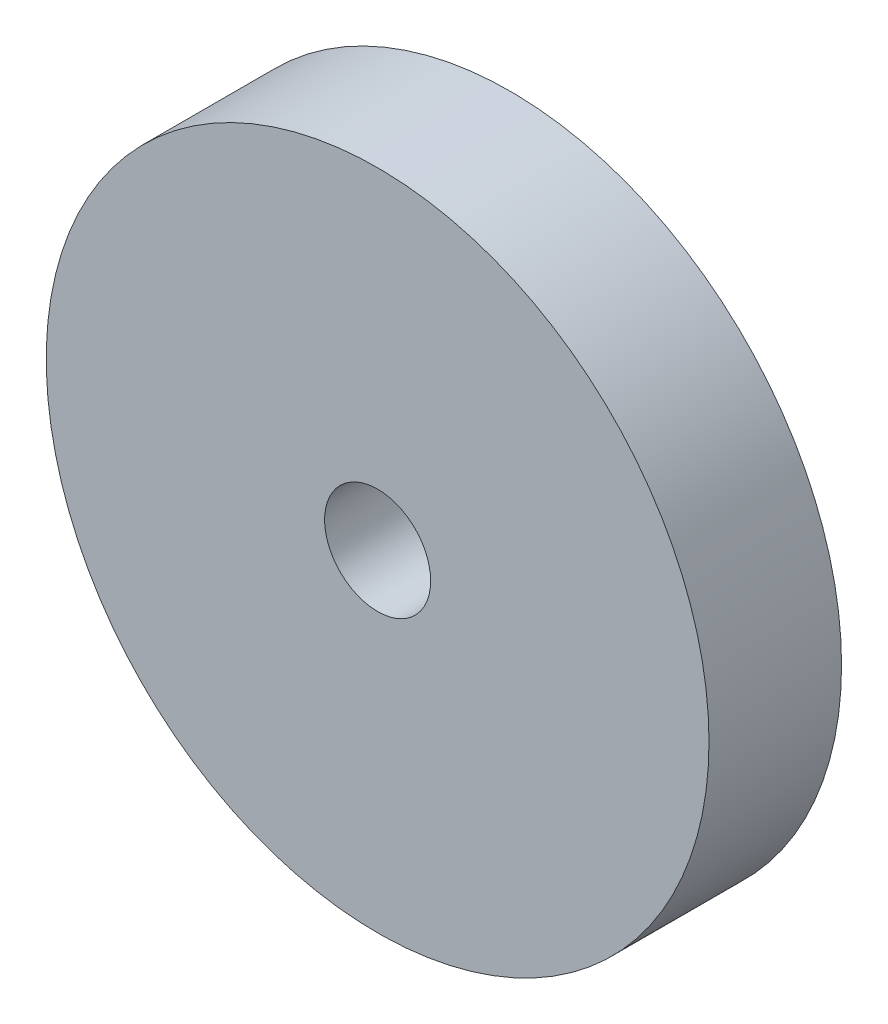
ISO-10303-21;
HEADER;
FILE_DESCRIPTION(('STEP AP214'),'2;1');
FILE_NAME('part.step','',(''),(''),'','','');
FILE_SCHEMA(('AUTOMOTIVE_DESIGN { 1 0 10303 214 1 1 1 1 }'));
ENDSEC;
DATA;
#1=APPLICATION_CONTEXT('core data for automotive mechanical design processes');
#2=APPLICATION_PROTOCOL_DEFINITION('international standard','automotive_design',2000,#1);
#3=PRODUCT_CONTEXT('',#1,'mechanical');
#4=PRODUCT('Part','Part','',(#3));
#5=PRODUCT_RELATED_PRODUCT_CATEGORY('part','',(#4));
#6=PRODUCT_DEFINITION_FORMATION('','',#4);
#7=PRODUCT_DEFINITION_CONTEXT('part definition',#1,'design');
#8=PRODUCT_DEFINITION('design','',#6,#7);
#9=PRODUCT_DEFINITION_SHAPE('','',#8);
#10=(LENGTH_UNIT() NAMED_UNIT(*) SI_UNIT(.MILLI.,.METRE.));
#11=(NAMED_UNIT(*) PLANE_ANGLE_UNIT() SI_UNIT($,.RADIAN.));
#12=(NAMED_UNIT(*) SI_UNIT($,.STERADIAN.) SOLID_ANGLE_UNIT());
#13=UNCERTAINTY_MEASURE_WITH_UNIT(LENGTH_MEASURE(1.E-05),#10,'distance_accuracy_value','');
#14=(GEOMETRIC_REPRESENTATION_CONTEXT(3) GLOBAL_UNCERTAINTY_ASSIGNED_CONTEXT((#13)) GLOBAL_UNIT_ASSIGNED_CONTEXT((#10,
#11,#12)) REPRESENTATION_CONTEXT('',''));
#15=CARTESIAN_POINT('',(0.,0.,0.));
#16=DIRECTION('',(0.,0.,1.));
#17=DIRECTION('',(1.,0.,0.));
#18=AXIS2_PLACEMENT_3D('',#15,#16,#17);
#19=CARTESIAN_POINT('',(-98.4635783674477,-276.505149473541,4.));
#20=DIRECTION('',(0.,0.,-1.));
#21=DIRECTION('',(-1.,0.,0.));
#22=AXIS2_PLACEMENT_3D('',#19,#20,#21);
#23=CYLINDRICAL_SURFACE('',#22,10.);
#24=CARTESIAN_POINT('',(-98.4635783674477,-276.505149473541,4.));
#25=DIRECTION('',(0.,0.,1.));
#26=DIRECTION('',(1.,0.,0.));
#27=AXIS2_PLACEMENT_3D('',#24,#25,#26);
#28=CIRCLE('',#27,10.);
#29=CARTESIAN_POINT('',(-88.4635783674477,-276.505149473541,4.));
#30=VERTEX_POINT('',#29);
#31=EDGE_CURVE('E11',#30,#30,#28,.T.);
#32=ORIENTED_EDGE('',*,*,#31,.F.);
#33=EDGE_LOOP('',(#32));
#34=FACE_BOUND('',#33,.T.);
#35=CARTESIAN_POINT('',(-98.4635783674477,-276.505149473541,0.));
#36=DIRECTION('',(0.,0.,1.));
#37=DIRECTION('',(1.,0.,0.));
#38=AXIS2_PLACEMENT_3D('',#35,#36,#37);
#39=CIRCLE('',#38,10.);
#40=CARTESIAN_POINT('',(-88.4635783674477,-276.505149473541,0.));
#41=VERTEX_POINT('',#40);
#42=EDGE_CURVE('E41',#41,#41,#39,.T.);
#43=ORIENTED_EDGE('',*,*,#42,.T.);
#44=EDGE_LOOP('',(#43));
#45=FACE_BOUND('',#44,.T.);
#46=ADVANCED_FACE('F38',(#34,#45),#23,.T.);
#47=CARTESIAN_POINT('',(-98.4635783674477,-276.505149473541,4.));
#48=DIRECTION('',(0.,0.,1.));
#49=DIRECTION('',(1.,0.,0.));
#50=AXIS2_PLACEMENT_3D('',#47,#48,#49);
#51=PLANE('',#50);
#52=CARTESIAN_POINT('',(-98.4635783674477,-276.505149473541,4.));
#53=DIRECTION('',(0.,0.,1.));
#54=DIRECTION('',(1.,0.,0.));
#55=AXIS2_PLACEMENT_3D('',#52,#53,#54);
#56=CIRCLE('',#55,1.59999999999999);
#57=CARTESIAN_POINT('',(-96.8635783674477,-276.505149473541,4.));
#58=VERTEX_POINT('',#57);
#59=EDGE_CURVE('E56',#58,#58,#56,.T.);
#60=ORIENTED_EDGE('',*,*,#59,.F.);
#61=EDGE_LOOP('',(#60));
#62=FACE_BOUND('',#61,.T.);
#63=ORIENTED_EDGE('',*,*,#31,.T.);
#64=EDGE_LOOP('',(#63));
#65=FACE_BOUND('',#64,.T.);
#66=ADVANCED_FACE('F71',(#62,#65),#51,.T.);
#67=CARTESIAN_POINT('',(-98.4635783674477,-276.505149473541,0.));
#68=DIRECTION('',(0.,0.,1.));
#69=DIRECTION('',(1.,0.,0.));
#70=AXIS2_PLACEMENT_3D('',#67,#68,#69);
#71=PLANE('',#70);
#72=CARTESIAN_POINT('',(-98.4635783674477,-276.505149473541,0.));
#73=DIRECTION('',(0.,0.,1.));
#74=DIRECTION('',(1.,0.,0.));
#75=AXIS2_PLACEMENT_3D('',#72,#73,#74);
#76=CIRCLE('',#75,1.59999999999999);
#77=CARTESIAN_POINT('',(-96.8635783674477,-276.505149473541,0.));
#78=VERTEX_POINT('',#77);
#79=EDGE_CURVE('E50',#78,#78,#76,.T.);
#80=ORIENTED_EDGE('',*,*,#79,.T.);
#81=EDGE_LOOP('',(#80));
#82=FACE_BOUND('',#81,.T.);
#83=ORIENTED_EDGE('',*,*,#42,.F.);
#84=EDGE_LOOP('',(#83));
#85=FACE_BOUND('',#84,.T.);
#86=ADVANCED_FACE('F73',(#82,#85),#71,.F.);
#87=CARTESIAN_POINT('',(-98.4635783674477,-276.505149473541,4.));
#88=DIRECTION('',(0.,0.,1.));
#89=DIRECTION('',(1.,0.,0.));
#90=AXIS2_PLACEMENT_3D('',#87,#88,#89);
#91=CYLINDRICAL_SURFACE('',#90,1.59999999999999);
#92=ORIENTED_EDGE('',*,*,#79,.F.);
#93=EDGE_LOOP('',(#92));
#94=FACE_BOUND('',#93,.T.);
#95=ORIENTED_EDGE('',*,*,#59,.T.);
#96=EDGE_LOOP('',(#95));
#97=FACE_BOUND('',#96,.T.);
#98=ADVANCED_FACE('F69',(#94,#97),#91,.F.);
#99=CLOSED_SHELL('',(#46,#66,#86,#98));
#100=MANIFOLD_SOLID_BREP('B2',#99);
#101=ADVANCED_BREP_SHAPE_REPRESENTATION('',(#18,#100),#14);
#102=SHAPE_DEFINITION_REPRESENTATION(#9,#101);
ENDSEC;
END-ISO-10303-21;
